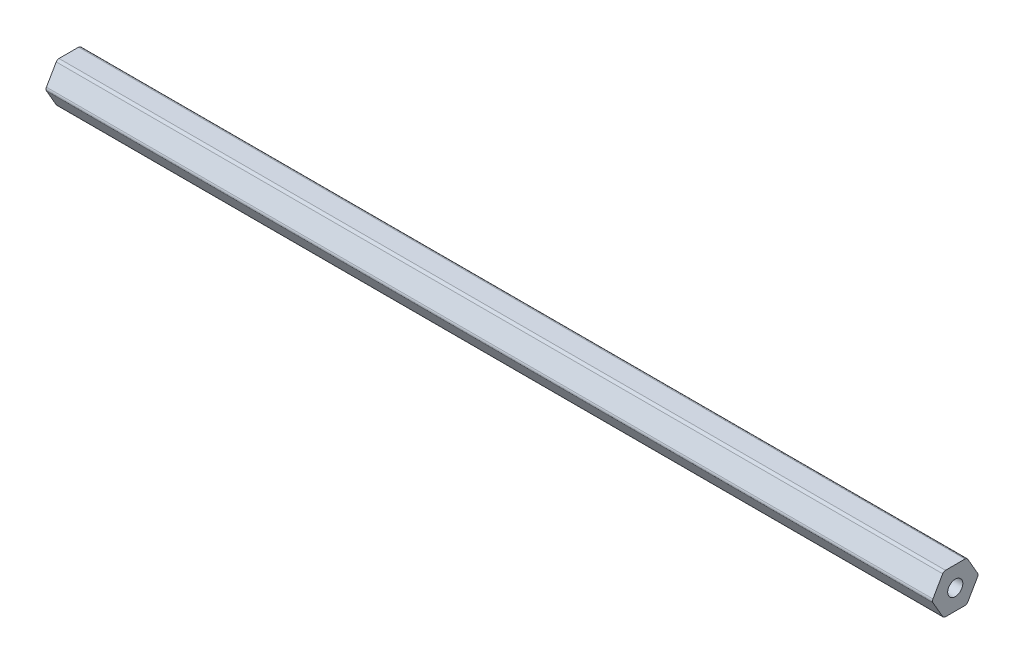
ISO-10303-21;
HEADER;
FILE_DESCRIPTION(('STEP AP214'),'2;1');
FILE_NAME('part.step','',(''),(''),'','','');
FILE_SCHEMA(('AUTOMOTIVE_DESIGN { 1 0 10303 214 1 1 1 1 }'));
ENDSEC;
DATA;
#1=APPLICATION_CONTEXT('core data for automotive mechanical design processes');
#2=APPLICATION_PROTOCOL_DEFINITION('international standard','automotive_design',2000,#1);
#3=PRODUCT_CONTEXT('',#1,'mechanical');
#4=PRODUCT('Part','Part','',(#3));
#5=PRODUCT_RELATED_PRODUCT_CATEGORY('part','',(#4));
#6=PRODUCT_DEFINITION_FORMATION('','',#4);
#7=PRODUCT_DEFINITION_CONTEXT('part definition',#1,'design');
#8=PRODUCT_DEFINITION('design','',#6,#7);
#9=PRODUCT_DEFINITION_SHAPE('','',#8);
#10=(LENGTH_UNIT() NAMED_UNIT(*) SI_UNIT(.MILLI.,.METRE.));
#11=(NAMED_UNIT(*) PLANE_ANGLE_UNIT() SI_UNIT($,.RADIAN.));
#12=(NAMED_UNIT(*) SI_UNIT($,.STERADIAN.) SOLID_ANGLE_UNIT());
#13=UNCERTAINTY_MEASURE_WITH_UNIT(LENGTH_MEASURE(1.E-05),#10,'distance_accuracy_value','');
#14=(GEOMETRIC_REPRESENTATION_CONTEXT(3) GLOBAL_UNCERTAINTY_ASSIGNED_CONTEXT((#13)) GLOBAL_UNIT_ASSIGNED_CONTEXT((#10,
#11,#12)) REPRESENTATION_CONTEXT('',''));
#15=CARTESIAN_POINT('',(0.,0.,0.));
#16=DIRECTION('',(0.,0.,1.));
#17=DIRECTION('',(1.,0.,0.));
#18=AXIS2_PLACEMENT_3D('',#15,#16,#17);
#19=CARTESIAN_POINT('',(279.4,5.334,-3.07958633585748));
#20=DIRECTION('',(-1.,0.,0.));
#21=DIRECTION('',(0.,0.,1.));
#22=AXIS2_PLACEMENT_3D('',#19,#20,#21);
#23=PLANE('',#22);
#24=CARTESIAN_POINT('',(279.4,5.334,-3.07958633585748));
#25=DIRECTION('',(1.,0.,0.));
#26=DIRECTION('',(0.,0.,1.));
#27=AXIS2_PLACEMENT_3D('',#24,#25,#26);
#28=CIRCLE('',#27,1.016);
#29=CARTESIAN_POINT('',(279.4,5.84199999999999,-3.95946814610247));
#30=VERTEX_POINT('',#29);
#31=CARTESIAN_POINT('',(279.4,6.34999999999999,-3.07958633585748));
#32=VERTEX_POINT('',#31);
#33=EDGE_CURVE('E206',#30,#32,#28,.T.);
#34=ORIENTED_EDGE('',*,*,#33,.T.);
#35=DIRECTION('',(0.,0.,1.));
#36=VECTOR('',#35,1.);
#37=CARTESIAN_POINT('',(279.4,6.34999999999999,-3.07958633585748));
#38=LINE('',#37,#36);
#39=CARTESIAN_POINT('',(279.4,6.35000000000001,3.07958633585745));
#40=VERTEX_POINT('',#39);
#41=EDGE_CURVE('E118',#32,#40,#38,.T.);
#42=ORIENTED_EDGE('',*,*,#41,.T.);
#43=CARTESIAN_POINT('',(279.4,5.33400000000001,3.07958633585745));
#44=DIRECTION('',(1.,0.,0.));
#45=DIRECTION('',(0.,0.,1.));
#46=AXIS2_PLACEMENT_3D('',#43,#44,#45);
#47=CIRCLE('',#46,1.016);
#48=CARTESIAN_POINT('',(279.4,5.84200000000001,3.95946814610244));
#49=VERTEX_POINT('',#48);
#50=EDGE_CURVE('E243',#40,#49,#47,.T.);
#51=ORIENTED_EDGE('',*,*,#50,.T.);
#52=DIRECTION('',(0.,-0.866025403784437,0.500000000000003));
#53=VECTOR('',#52,1.);
#54=CARTESIAN_POINT('',(279.4,5.84200000000001,3.95946814610244));
#55=LINE('',#54,#53);
#56=CARTESIAN_POINT('',(279.4,0.508000000000022,7.03905448195992));
#57=VERTEX_POINT('',#56);
#58=EDGE_CURVE('E263',#49,#57,#55,.T.);
#59=ORIENTED_EDGE('',*,*,#58,.T.);
#60=CARTESIAN_POINT('',(279.4,0.,6.15917267171493));
#61=DIRECTION('',(1.,0.,0.));
#62=DIRECTION('',(0.,0.,1.));
#63=AXIS2_PLACEMENT_3D('',#60,#61,#62);
#64=CIRCLE('',#63,1.016);
#65=CARTESIAN_POINT('',(279.4,-0.50799999999998,7.03905448195993));
#66=VERTEX_POINT('',#65);
#67=EDGE_CURVE('E259',#57,#66,#64,.T.);
#68=ORIENTED_EDGE('',*,*,#67,.T.);
#69=DIRECTION('',(0.,-0.86602540378444,-0.499999999999998));
#70=VECTOR('',#69,1.);
#71=CARTESIAN_POINT('',(279.4,-0.507999999999979,7.03905448195992));
#72=LINE('',#71,#70);
#73=CARTESIAN_POINT('',(279.4,-5.84199999999999,3.95946814610247));
#74=VERTEX_POINT('',#73);
#75=EDGE_CURVE('E262',#66,#74,#72,.T.);
#76=ORIENTED_EDGE('',*,*,#75,.T.);
#77=CARTESIAN_POINT('',(279.4,-5.334,3.07958633585748));
#78=DIRECTION('',(1.,0.,0.));
#79=DIRECTION('',(0.,0.,1.));
#80=AXIS2_PLACEMENT_3D('',#77,#78,#79);
#81=CIRCLE('',#80,1.016);
#82=CARTESIAN_POINT('',(279.4,-6.35,3.07958633585748));
#83=VERTEX_POINT('',#82);
#84=EDGE_CURVE('E267',#74,#83,#81,.T.);
#85=ORIENTED_EDGE('',*,*,#84,.T.);
#86=DIRECTION('',(0.,0.,-1.));
#87=VECTOR('',#86,1.);
#88=CARTESIAN_POINT('',(279.4,-6.35,3.07958633585748));
#89=LINE('',#88,#87);
#90=CARTESIAN_POINT('',(279.4,-6.35000000000001,-3.07958633585745));
#91=VERTEX_POINT('',#90);
#92=EDGE_CURVE('E274',#83,#91,#89,.T.);
#93=ORIENTED_EDGE('',*,*,#92,.T.);
#94=CARTESIAN_POINT('',(279.4,-5.33400000000001,-3.07958633585745));
#95=DIRECTION('',(1.,0.,0.));
#96=DIRECTION('',(0.,0.,1.));
#97=AXIS2_PLACEMENT_3D('',#94,#95,#96);
#98=CIRCLE('',#97,1.016);
#99=CARTESIAN_POINT('',(279.4,-5.84200000000001,-3.95946814610244));
#100=VERTEX_POINT('',#99);
#101=EDGE_CURVE('E149',#91,#100,#98,.T.);
#102=ORIENTED_EDGE('',*,*,#101,.T.);
#103=DIRECTION('',(0.,0.866025403784437,-0.500000000000002));
#104=VECTOR('',#103,1.);
#105=CARTESIAN_POINT('',(279.4,-5.84200000000001,-3.95946814610244));
#106=LINE('',#105,#104);
#107=CARTESIAN_POINT('',(279.4,-0.508000000000019,-7.03905448195992));
#108=VERTEX_POINT('',#107);
#109=EDGE_CURVE('E143',#100,#108,#106,.T.);
#110=ORIENTED_EDGE('',*,*,#109,.T.);
#111=CARTESIAN_POINT('',(279.4,0.,-6.15917267171493));
#112=DIRECTION('',(1.,0.,0.));
#113=DIRECTION('',(0.,0.,1.));
#114=AXIS2_PLACEMENT_3D('',#111,#112,#113);
#115=CIRCLE('',#114,1.016);
#116=CARTESIAN_POINT('',(279.4,0.507999999999981,-7.03905448195992));
#117=VERTEX_POINT('',#116);
#118=EDGE_CURVE('E147',#108,#117,#115,.T.);
#119=ORIENTED_EDGE('',*,*,#118,.T.);
#120=DIRECTION('',(0.,0.86602540378444,0.499999999999997));
#121=VECTOR('',#120,1.);
#122=CARTESIAN_POINT('',(279.4,0.50799999999998,-7.03905448195992));
#123=LINE('',#122,#121);
#124=EDGE_CURVE('E63',#117,#30,#123,.T.);
#125=ORIENTED_EDGE('',*,*,#124,.T.);
#126=EDGE_LOOP('',(#34,#42,#51,#59,#68,#76,#85,#93,#102,#110,#119,#125));
#127=FACE_BOUND('',#126,.T.);
#128=CARTESIAN_POINT('',(279.4,0.,0.));
#129=DIRECTION('',(1.,0.,0.));
#130=DIRECTION('',(0.,0.,-1.));
#131=AXIS2_PLACEMENT_3D('',#128,#129,#130);
#132=CIRCLE('',#131,2.38125);
#133=CARTESIAN_POINT('',(279.4,0.,-2.38125));
#134=VERTEX_POINT('',#133);
#135=EDGE_CURVE('E176',#134,#134,#132,.T.);
#136=ORIENTED_EDGE('',*,*,#135,.F.);
#137=EDGE_LOOP('',(#136));
#138=FACE_BOUND('',#137,.T.);
#139=ADVANCED_FACE('F45',(#127,#138),#23,.F.);
#140=CARTESIAN_POINT('',(0.,5.334,-3.07958633585748));
#141=DIRECTION('',(-1.,0.,0.));
#142=DIRECTION('',(0.,0.,1.));
#143=AXIS2_PLACEMENT_3D('',#140,#141,#142);
#144=PLANE('',#143);
#145=CARTESIAN_POINT('',(0.,5.334,-3.07958633585748));
#146=DIRECTION('',(1.,0.,0.));
#147=DIRECTION('',(0.,0.,1.));
#148=AXIS2_PLACEMENT_3D('',#145,#146,#147);
#149=CIRCLE('',#148,1.016);
#150=CARTESIAN_POINT('',(0.,5.84199999999999,-3.95946814610247));
#151=VERTEX_POINT('',#150);
#152=CARTESIAN_POINT('',(0.,6.34999999999999,-3.07958633585748));
#153=VERTEX_POINT('',#152);
#154=EDGE_CURVE('E171',#151,#153,#149,.T.);
#155=ORIENTED_EDGE('',*,*,#154,.F.);
#156=DIRECTION('',(0.,0.86602540378444,0.499999999999997));
#157=VECTOR('',#156,1.);
#158=CARTESIAN_POINT('',(0.,0.50799999999998,-7.03905448195992));
#159=LINE('',#158,#157);
#160=CARTESIAN_POINT('',(0.,0.507999999999981,-7.03905448195992));
#161=VERTEX_POINT('',#160);
#162=EDGE_CURVE('E110',#161,#151,#159,.T.);
#163=ORIENTED_EDGE('',*,*,#162,.F.);
#164=CARTESIAN_POINT('',(0.,0.,-6.15917267171493));
#165=DIRECTION('',(1.,0.,0.));
#166=DIRECTION('',(0.,0.,1.));
#167=AXIS2_PLACEMENT_3D('',#164,#165,#166);
#168=CIRCLE('',#167,1.016);
#169=CARTESIAN_POINT('',(0.,-0.508000000000019,-7.03905448195992));
#170=VERTEX_POINT('',#169);
#171=EDGE_CURVE('E104',#170,#161,#168,.T.);
#172=ORIENTED_EDGE('',*,*,#171,.F.);
#173=DIRECTION('',(0.,0.866025403784437,-0.500000000000002));
#174=VECTOR('',#173,1.);
#175=CARTESIAN_POINT('',(0.,-5.84200000000001,-3.95946814610244));
#176=LINE('',#175,#174);
#177=CARTESIAN_POINT('',(0.,-5.84200000000001,-3.95946814610244));
#178=VERTEX_POINT('',#177);
#179=EDGE_CURVE('E158',#178,#170,#176,.T.);
#180=ORIENTED_EDGE('',*,*,#179,.F.);
#181=CARTESIAN_POINT('',(0.,-5.33400000000001,-3.07958633585745));
#182=DIRECTION('',(1.,0.,0.));
#183=DIRECTION('',(0.,0.,1.));
#184=AXIS2_PLACEMENT_3D('',#181,#182,#183);
#185=CIRCLE('',#184,1.016);
#186=CARTESIAN_POINT('',(0.,-6.35000000000001,-3.07958633585745));
#187=VERTEX_POINT('',#186);
#188=EDGE_CURVE('E197',#187,#178,#185,.T.);
#189=ORIENTED_EDGE('',*,*,#188,.F.);
#190=DIRECTION('',(0.,0.,-1.));
#191=VECTOR('',#190,1.);
#192=CARTESIAN_POINT('',(0.,-6.35,3.07958633585748));
#193=LINE('',#192,#191);
#194=CARTESIAN_POINT('',(0.,-6.35,3.07958633585748));
#195=VERTEX_POINT('',#194);
#196=EDGE_CURVE('E194',#195,#187,#193,.T.);
#197=ORIENTED_EDGE('',*,*,#196,.F.);
#198=CARTESIAN_POINT('',(0.,-5.334,3.07958633585748));
#199=DIRECTION('',(1.,0.,0.));
#200=DIRECTION('',(0.,0.,1.));
#201=AXIS2_PLACEMENT_3D('',#198,#199,#200);
#202=CIRCLE('',#201,1.016);
#203=CARTESIAN_POINT('',(0.,-5.84199999999999,3.95946814610247));
#204=VERTEX_POINT('',#203);
#205=EDGE_CURVE('E191',#204,#195,#202,.T.);
#206=ORIENTED_EDGE('',*,*,#205,.F.);
#207=DIRECTION('',(0.,-0.86602540378444,-0.499999999999998));
#208=VECTOR('',#207,1.);
#209=CARTESIAN_POINT('',(0.,-0.507999999999979,7.03905448195992));
#210=LINE('',#209,#208);
#211=CARTESIAN_POINT('',(0.,-0.50799999999998,7.03905448195993));
#212=VERTEX_POINT('',#211);
#213=EDGE_CURVE('E188',#212,#204,#210,.T.);
#214=ORIENTED_EDGE('',*,*,#213,.F.);
#215=CARTESIAN_POINT('',(0.,0.,6.15917267171493));
#216=DIRECTION('',(1.,0.,0.));
#217=DIRECTION('',(0.,0.,1.));
#218=AXIS2_PLACEMENT_3D('',#215,#216,#217);
#219=CIRCLE('',#218,1.016);
#220=CARTESIAN_POINT('',(0.,0.508000000000022,7.03905448195992));
#221=VERTEX_POINT('',#220);
#222=EDGE_CURVE('E185',#221,#212,#219,.T.);
#223=ORIENTED_EDGE('',*,*,#222,.F.);
#224=DIRECTION('',(0.,-0.866025403784437,0.500000000000003));
#225=VECTOR('',#224,1.);
#226=CARTESIAN_POINT('',(0.,5.84200000000001,3.95946814610244));
#227=LINE('',#226,#225);
#228=CARTESIAN_POINT('',(0.,5.84200000000001,3.95946814610244));
#229=VERTEX_POINT('',#228);
#230=EDGE_CURVE('E182',#229,#221,#227,.T.);
#231=ORIENTED_EDGE('',*,*,#230,.F.);
#232=CARTESIAN_POINT('',(0.,5.33400000000001,3.07958633585745));
#233=DIRECTION('',(1.,0.,0.));
#234=DIRECTION('',(0.,0.,1.));
#235=AXIS2_PLACEMENT_3D('',#232,#233,#234);
#236=CIRCLE('',#235,1.016);
#237=CARTESIAN_POINT('',(0.,6.35000000000001,3.07958633585745));
#238=VERTEX_POINT('',#237);
#239=EDGE_CURVE('E179',#238,#229,#236,.T.);
#240=ORIENTED_EDGE('',*,*,#239,.F.);
#241=DIRECTION('',(0.,0.,1.));
#242=VECTOR('',#241,1.);
#243=CARTESIAN_POINT('',(0.,6.34999999999999,-3.07958633585748));
#244=LINE('',#243,#242);
#245=EDGE_CURVE('E175',#153,#238,#244,.T.);
#246=ORIENTED_EDGE('',*,*,#245,.F.);
#247=EDGE_LOOP('',(#155,#163,#172,#180,#189,#197,#206,#214,#223,#231,#240,#246));
#248=FACE_BOUND('',#247,.T.);
#249=CARTESIAN_POINT('',(0.,0.,0.));
#250=DIRECTION('',(1.,0.,0.));
#251=DIRECTION('',(0.,0.,-1.));
#252=AXIS2_PLACEMENT_3D('',#249,#250,#251);
#253=CIRCLE('',#252,2.38125);
#254=CARTESIAN_POINT('',(0.,0.,-2.38125));
#255=VERTEX_POINT('',#254);
#256=EDGE_CURVE('E474',#255,#255,#253,.T.);
#257=ORIENTED_EDGE('',*,*,#256,.T.);
#258=EDGE_LOOP('',(#257));
#259=FACE_BOUND('',#258,.T.);
#260=ADVANCED_FACE('F247',(#248,#259),#144,.T.);
#261=CARTESIAN_POINT('',(279.4,5.334,-3.07958633585748));
#262=DIRECTION('',(-1.,0.,0.));
#263=DIRECTION('',(0.,0.,1.));
#264=AXIS2_PLACEMENT_3D('',#261,#262,#263);
#265=CYLINDRICAL_SURFACE('',#264,1.016);
#266=ORIENTED_EDGE('',*,*,#154,.T.);
#267=DIRECTION('',(-1.,0.,0.));
#268=VECTOR('',#267,1.);
#269=CARTESIAN_POINT('',(279.4,6.34999999999999,-3.07958633585748));
#270=LINE('',#269,#268);
#271=EDGE_CURVE('E11',#32,#153,#270,.T.);
#272=ORIENTED_EDGE('',*,*,#271,.F.);
#273=ORIENTED_EDGE('',*,*,#33,.F.);
#274=DIRECTION('',(-1.,0.,0.));
#275=VECTOR('',#274,1.);
#276=CARTESIAN_POINT('',(279.4,5.84199999999999,-3.95946814610247));
#277=LINE('',#276,#275);
#278=EDGE_CURVE('E167',#30,#151,#277,.T.);
#279=ORIENTED_EDGE('',*,*,#278,.T.);
#280=EDGE_LOOP('',(#266,#272,#273,#279));
#281=FACE_BOUND('',#280,.T.);
#282=ADVANCED_FACE('F47',(#281),#265,.T.);
#283=CARTESIAN_POINT('',(279.4,6.34999999999999,-3.07958633585748));
#284=DIRECTION('',(0.,-1.,0.));
#285=DIRECTION('',(0.,0.,-1.));
#286=AXIS2_PLACEMENT_3D('',#283,#284,#285);
#287=PLANE('',#286);
#288=ORIENTED_EDGE('',*,*,#245,.T.);
#289=DIRECTION('',(-1.,0.,0.));
#290=VECTOR('',#289,1.);
#291=CARTESIAN_POINT('',(279.4,6.35000000000001,3.07958633585745));
#292=LINE('',#291,#290);
#293=EDGE_CURVE('E55',#40,#238,#292,.T.);
#294=ORIENTED_EDGE('',*,*,#293,.F.);
#295=ORIENTED_EDGE('',*,*,#41,.F.);
#296=ORIENTED_EDGE('',*,*,#271,.T.);
#297=EDGE_LOOP('',(#288,#294,#295,#296));
#298=FACE_BOUND('',#297,.T.);
#299=ADVANCED_FACE('F310',(#298),#287,.F.);
#300=CARTESIAN_POINT('',(279.4,5.33400000000001,3.07958633585745));
#301=DIRECTION('',(-1.,0.,0.));
#302=DIRECTION('',(0.,0.,1.));
#303=AXIS2_PLACEMENT_3D('',#300,#301,#302);
#304=CYLINDRICAL_SURFACE('',#303,1.016);
#305=ORIENTED_EDGE('',*,*,#239,.T.);
#306=DIRECTION('',(-1.,0.,0.));
#307=VECTOR('',#306,1.);
#308=CARTESIAN_POINT('',(279.4,5.84200000000001,3.95946814610244));
#309=LINE('',#308,#307);
#310=EDGE_CURVE('E233',#49,#229,#309,.T.);
#311=ORIENTED_EDGE('',*,*,#310,.F.);
#312=ORIENTED_EDGE('',*,*,#50,.F.);
#313=ORIENTED_EDGE('',*,*,#293,.T.);
#314=EDGE_LOOP('',(#305,#311,#312,#313));
#315=FACE_BOUND('',#314,.T.);
#316=ADVANCED_FACE('F241',(#315),#304,.T.);
#317=CARTESIAN_POINT('',(279.4,5.84200000000001,3.95946814610244));
#318=DIRECTION('',(0.,-0.500000000000003,-0.866025403784437));
#319=DIRECTION('',(0.,0.866025403784437,-0.500000000000003));
#320=AXIS2_PLACEMENT_3D('',#317,#318,#319);
#321=PLANE('',#320);
#322=ORIENTED_EDGE('',*,*,#230,.T.);
#323=DIRECTION('',(-1.,0.,0.));
#324=VECTOR('',#323,1.);
#325=CARTESIAN_POINT('',(279.4,0.508000000000022,7.03905448195992));
#326=LINE('',#325,#324);
#327=EDGE_CURVE('E229',#57,#221,#326,.T.);
#328=ORIENTED_EDGE('',*,*,#327,.F.);
#329=ORIENTED_EDGE('',*,*,#58,.F.);
#330=ORIENTED_EDGE('',*,*,#310,.T.);
#331=EDGE_LOOP('',(#322,#328,#329,#330));
#332=FACE_BOUND('',#331,.T.);
#333=ADVANCED_FACE('F253',(#332),#321,.F.);
#334=CARTESIAN_POINT('',(279.4,0.,6.15917267171493));
#335=DIRECTION('',(-1.,0.,0.));
#336=DIRECTION('',(0.,0.,1.));
#337=AXIS2_PLACEMENT_3D('',#334,#335,#336);
#338=CYLINDRICAL_SURFACE('',#337,1.016);
#339=ORIENTED_EDGE('',*,*,#222,.T.);
#340=DIRECTION('',(-1.,0.,0.));
#341=VECTOR('',#340,1.);
#342=CARTESIAN_POINT('',(279.4,-0.50799999999998,7.03905448195993));
#343=LINE('',#342,#341);
#344=EDGE_CURVE('E225',#66,#212,#343,.T.);
#345=ORIENTED_EDGE('',*,*,#344,.F.);
#346=ORIENTED_EDGE('',*,*,#67,.F.);
#347=ORIENTED_EDGE('',*,*,#327,.T.);
#348=EDGE_LOOP('',(#339,#345,#346,#347));
#349=FACE_BOUND('',#348,.T.);
#350=ADVANCED_FACE('F257',(#349),#338,.T.);
#351=CARTESIAN_POINT('',(279.4,-0.507999999999979,7.03905448195992));
#352=DIRECTION('',(0.,0.499999999999998,-0.86602540378444));
#353=DIRECTION('',(0.,0.86602540378444,0.499999999999998));
#354=AXIS2_PLACEMENT_3D('',#351,#352,#353);
#355=PLANE('',#354);
#356=ORIENTED_EDGE('',*,*,#213,.T.);
#357=DIRECTION('',(-1.,0.,0.));
#358=VECTOR('',#357,1.);
#359=CARTESIAN_POINT('',(279.4,-5.84199999999999,3.95946814610247));
#360=LINE('',#359,#358);
#361=EDGE_CURVE('E221',#74,#204,#360,.T.);
#362=ORIENTED_EDGE('',*,*,#361,.F.);
#363=ORIENTED_EDGE('',*,*,#75,.F.);
#364=ORIENTED_EDGE('',*,*,#344,.T.);
#365=EDGE_LOOP('',(#356,#362,#363,#364));
#366=FACE_BOUND('',#365,.T.);
#367=ADVANCED_FACE('F323',(#366),#355,.F.);
#368=CARTESIAN_POINT('',(279.4,-5.334,3.07958633585748));
#369=DIRECTION('',(-1.,0.,0.));
#370=DIRECTION('',(0.,0.,1.));
#371=AXIS2_PLACEMENT_3D('',#368,#369,#370);
#372=CYLINDRICAL_SURFACE('',#371,1.016);
#373=ORIENTED_EDGE('',*,*,#205,.T.);
#374=DIRECTION('',(-1.,0.,0.));
#375=VECTOR('',#374,1.);
#376=CARTESIAN_POINT('',(279.4,-6.35,3.07958633585748));
#377=LINE('',#376,#375);
#378=EDGE_CURVE('E217',#83,#195,#377,.T.);
#379=ORIENTED_EDGE('',*,*,#378,.F.);
#380=ORIENTED_EDGE('',*,*,#84,.F.);
#381=ORIENTED_EDGE('',*,*,#361,.T.);
#382=EDGE_LOOP('',(#373,#379,#380,#381));
#383=FACE_BOUND('',#382,.T.);
#384=ADVANCED_FACE('F326',(#383),#372,.T.);
#385=CARTESIAN_POINT('',(279.4,-6.35,3.07958633585748));
#386=DIRECTION('',(0.,1.,0.));
#387=DIRECTION('',(0.,0.,1.));
#388=AXIS2_PLACEMENT_3D('',#385,#386,#387);
#389=PLANE('',#388);
#390=ORIENTED_EDGE('',*,*,#196,.T.);
#391=DIRECTION('',(-1.,0.,0.));
#392=VECTOR('',#391,1.);
#393=CARTESIAN_POINT('',(279.4,-6.35000000000001,-3.07958633585745));
#394=LINE('',#393,#392);
#395=EDGE_CURVE('E213',#91,#187,#394,.T.);
#396=ORIENTED_EDGE('',*,*,#395,.F.);
#397=ORIENTED_EDGE('',*,*,#92,.F.);
#398=ORIENTED_EDGE('',*,*,#378,.T.);
#399=EDGE_LOOP('',(#390,#396,#397,#398));
#400=FACE_BOUND('',#399,.T.);
#401=ADVANCED_FACE('F282',(#400),#389,.F.);
#402=CARTESIAN_POINT('',(279.4,-5.33400000000001,-3.07958633585745));
#403=DIRECTION('',(-1.,0.,0.));
#404=DIRECTION('',(0.,0.,1.));
#405=AXIS2_PLACEMENT_3D('',#402,#403,#404);
#406=CYLINDRICAL_SURFACE('',#405,1.016);
#407=ORIENTED_EDGE('',*,*,#188,.T.);
#408=DIRECTION('',(-1.,0.,0.));
#409=VECTOR('',#408,1.);
#410=CARTESIAN_POINT('',(279.4,-5.84200000000001,-3.95946814610244));
#411=LINE('',#410,#409);
#412=EDGE_CURVE('E160',#100,#178,#411,.T.);
#413=ORIENTED_EDGE('',*,*,#412,.F.);
#414=ORIENTED_EDGE('',*,*,#101,.F.);
#415=ORIENTED_EDGE('',*,*,#395,.T.);
#416=EDGE_LOOP('',(#407,#413,#414,#415));
#417=FACE_BOUND('',#416,.T.);
#418=ADVANCED_FACE('F286',(#417),#406,.T.);
#419=CARTESIAN_POINT('',(279.4,-5.84200000000001,-3.95946814610244));
#420=DIRECTION('',(0.,0.500000000000003,0.866025403784437));
#421=DIRECTION('',(0.,-0.866025403784437,0.500000000000003));
#422=AXIS2_PLACEMENT_3D('',#419,#420,#421);
#423=PLANE('',#422);
#424=ORIENTED_EDGE('',*,*,#179,.T.);
#425=DIRECTION('',(-1.,0.,0.));
#426=VECTOR('',#425,1.);
#427=CARTESIAN_POINT('',(279.4,-0.508000000000019,-7.03905448195992));
#428=LINE('',#427,#426);
#429=EDGE_CURVE('E155',#108,#170,#428,.T.);
#430=ORIENTED_EDGE('',*,*,#429,.F.);
#431=ORIENTED_EDGE('',*,*,#109,.F.);
#432=ORIENTED_EDGE('',*,*,#412,.T.);
#433=EDGE_LOOP('',(#424,#430,#431,#432));
#434=FACE_BOUND('',#433,.T.);
#435=ADVANCED_FACE('F156',(#434),#423,.F.);
#436=CARTESIAN_POINT('',(279.4,0.,-6.15917267171493));
#437=DIRECTION('',(-1.,0.,0.));
#438=DIRECTION('',(0.,0.,1.));
#439=AXIS2_PLACEMENT_3D('',#436,#437,#438);
#440=CYLINDRICAL_SURFACE('',#439,1.016);
#441=ORIENTED_EDGE('',*,*,#171,.T.);
#442=DIRECTION('',(-1.,0.,0.));
#443=VECTOR('',#442,1.);
#444=CARTESIAN_POINT('',(279.4,0.507999999999981,-7.03905448195992));
#445=LINE('',#444,#443);
#446=EDGE_CURVE('E161',#117,#161,#445,.T.);
#447=ORIENTED_EDGE('',*,*,#446,.F.);
#448=ORIENTED_EDGE('',*,*,#118,.F.);
#449=ORIENTED_EDGE('',*,*,#429,.T.);
#450=EDGE_LOOP('',(#441,#447,#448,#449));
#451=FACE_BOUND('',#450,.T.);
#452=ADVANCED_FACE('F163',(#451),#440,.T.);
#453=CARTESIAN_POINT('',(279.4,0.50799999999998,-7.03905448195992));
#454=DIRECTION('',(0.,-0.499999999999997,0.86602540378444));
#455=DIRECTION('',(0.,-0.86602540378444,-0.499999999999997));
#456=AXIS2_PLACEMENT_3D('',#453,#454,#455);
#457=PLANE('',#456);
#458=ORIENTED_EDGE('',*,*,#162,.T.);
#459=ORIENTED_EDGE('',*,*,#278,.F.);
#460=ORIENTED_EDGE('',*,*,#124,.F.);
#461=ORIENTED_EDGE('',*,*,#446,.T.);
#462=EDGE_LOOP('',(#458,#459,#460,#461));
#463=FACE_BOUND('',#462,.T.);
#464=ADVANCED_FACE('F290',(#463),#457,.F.);
#465=CARTESIAN_POINT('',(279.4,0.,0.));
#466=DIRECTION('',(-1.,0.,0.));
#467=DIRECTION('',(0.,0.,1.));
#468=AXIS2_PLACEMENT_3D('',#465,#466,#467);
#469=CYLINDRICAL_SURFACE('',#468,2.38125);
#470=ORIENTED_EDGE('',*,*,#135,.T.);
#471=EDGE_LOOP('',(#470));
#472=FACE_BOUND('',#471,.T.);
#473=ORIENTED_EDGE('',*,*,#256,.F.);
#474=EDGE_LOOP('',(#473));
#475=FACE_BOUND('',#474,.T.);
#476=ADVANCED_FACE('F292',(#472,#475),#469,.F.);
#477=CLOSED_SHELL('',(#139,#260,#282,#299,#316,#333,#350,#367,#384,#401,#418,#435,#452,#464,#476));
#478=MANIFOLD_SOLID_BREP('B2',#477);
#479=ADVANCED_BREP_SHAPE_REPRESENTATION('',(#18,#478),#14);
#480=SHAPE_DEFINITION_REPRESENTATION(#9,#479);
ENDSEC;
END-ISO-10303-21;
